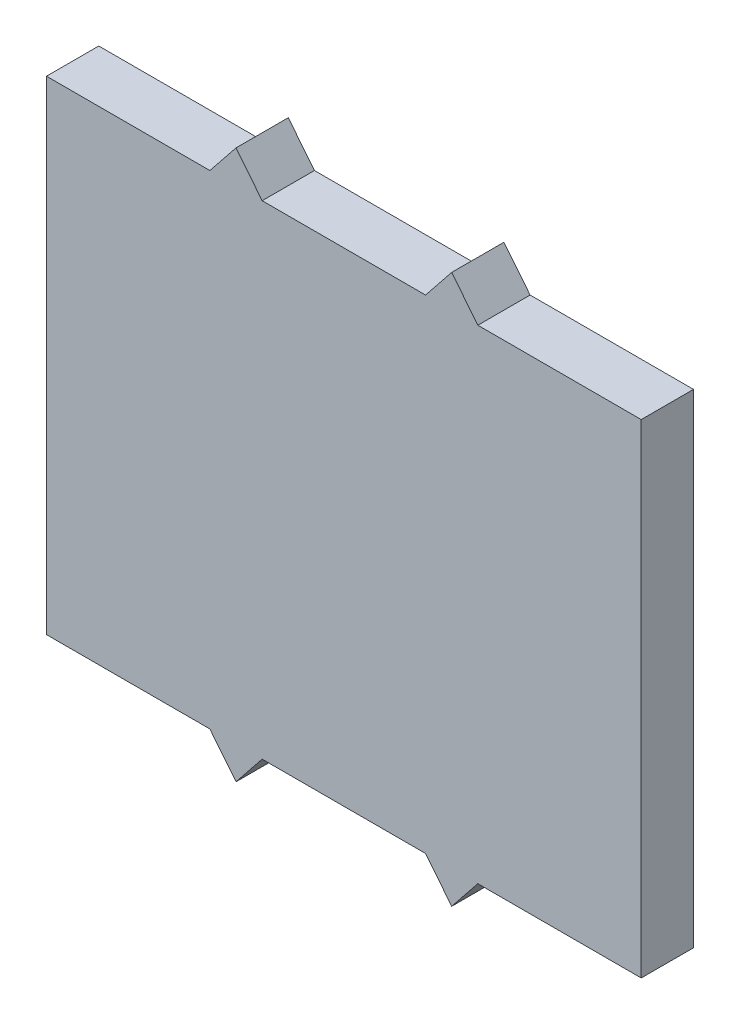
ISO-10303-21;
HEADER;
FILE_DESCRIPTION(('STEP AP214'),'2;1');
FILE_NAME('part.step','',(''),(''),'','','');
FILE_SCHEMA(('AUTOMOTIVE_DESIGN { 1 0 10303 214 1 1 1 1 }'));
ENDSEC;
DATA;
#1=APPLICATION_CONTEXT('core data for automotive mechanical design processes');
#2=APPLICATION_PROTOCOL_DEFINITION('international standard','automotive_design',2000,#1);
#3=PRODUCT_CONTEXT('',#1,'mechanical');
#4=PRODUCT('Part','Part','',(#3));
#5=PRODUCT_RELATED_PRODUCT_CATEGORY('part','',(#4));
#6=PRODUCT_DEFINITION_FORMATION('','',#4);
#7=PRODUCT_DEFINITION_CONTEXT('part definition',#1,'design');
#8=PRODUCT_DEFINITION('design','',#6,#7);
#9=PRODUCT_DEFINITION_SHAPE('','',#8);
#10=(LENGTH_UNIT() NAMED_UNIT(*) SI_UNIT(.MILLI.,.METRE.));
#11=(NAMED_UNIT(*) PLANE_ANGLE_UNIT() SI_UNIT($,.RADIAN.));
#12=(NAMED_UNIT(*) SI_UNIT($,.STERADIAN.) SOLID_ANGLE_UNIT());
#13=UNCERTAINTY_MEASURE_WITH_UNIT(LENGTH_MEASURE(1.E-05),#10,'distance_accuracy_value','');
#14=(GEOMETRIC_REPRESENTATION_CONTEXT(3) GLOBAL_UNCERTAINTY_ASSIGNED_CONTEXT((#13)) GLOBAL_UNIT_ASSIGNED_CONTEXT((#10,
#11,#12)) REPRESENTATION_CONTEXT('',''));
#15=CARTESIAN_POINT('',(0.,0.,0.));
#16=DIRECTION('',(0.,0.,1.));
#17=DIRECTION('',(1.,0.,0.));
#18=AXIS2_PLACEMENT_3D('',#15,#16,#17);
#19=CARTESIAN_POINT('',(0.,0.,4.));
#20=DIRECTION('',(0.,1.,0.));
#21=DIRECTION('',(0.,0.,1.));
#22=AXIS2_PLACEMENT_3D('',#19,#20,#21);
#23=PLANE('',#22);
#24=DIRECTION('',(1.,0.,0.));
#25=VECTOR('',#24,1.);
#26=CARTESIAN_POINT('',(0.,0.,0.));
#27=LINE('',#26,#25);
#28=CARTESIAN_POINT('',(0.,0.,0.));
#29=VERTEX_POINT('',#28);
#30=CARTESIAN_POINT('',(12.5,0.,0.));
#31=VERTEX_POINT('',#30);
#32=EDGE_CURVE('E254',#29,#31,#27,.T.);
#33=ORIENTED_EDGE('',*,*,#32,.T.);
#34=DIRECTION('',(0.,0.,-1.));
#35=VECTOR('',#34,1.);
#36=CARTESIAN_POINT('',(12.5,0.,4.));
#37=LINE('',#36,#35);
#38=CARTESIAN_POINT('',(12.5,0.,4.));
#39=VERTEX_POINT('',#38);
#40=EDGE_CURVE('E11',#39,#31,#37,.T.);
#41=ORIENTED_EDGE('',*,*,#40,.F.);
#42=DIRECTION('',(1.,0.,0.));
#43=VECTOR('',#42,1.);
#44=CARTESIAN_POINT('',(0.,0.,4.));
#45=LINE('',#44,#43);
#46=CARTESIAN_POINT('',(0.,0.,4.));
#47=VERTEX_POINT('',#46);
#48=EDGE_CURVE('E200',#47,#39,#45,.T.);
#49=ORIENTED_EDGE('',*,*,#48,.F.);
#50=DIRECTION('',(0.,0.,-1.));
#51=VECTOR('',#50,1.);
#52=CARTESIAN_POINT('',(0.,0.,4.));
#53=LINE('',#52,#51);
#54=EDGE_CURVE('E56',#47,#29,#53,.T.);
#55=ORIENTED_EDGE('',*,*,#54,.T.);
#56=EDGE_LOOP('',(#33,#41,#49,#55));
#57=FACE_BOUND('',#56,.T.);
#58=ADVANCED_FACE('F39',(#57),#23,.F.);
#59=CARTESIAN_POINT('',(7.6219512195122,6.09756097560976,4.));
#60=DIRECTION('',(0.78086880944303,0.624695047554424,0.));
#61=DIRECTION('',(-0.624695047554424,0.78086880944303,0.));
#62=AXIS2_PLACEMENT_3D('',#59,#60,#61);
#63=PLANE('',#62);
#64=DIRECTION('',(0.624695047554424,-0.78086880944303,0.));
#65=VECTOR('',#64,1.);
#66=CARTESIAN_POINT('',(7.6219512195122,6.09756097560976,0.));
#67=LINE('',#66,#65);
#68=CARTESIAN_POINT('',(14.5,-2.5,0.));
#69=VERTEX_POINT('',#68);
#70=EDGE_CURVE('E251',#31,#69,#67,.T.);
#71=ORIENTED_EDGE('',*,*,#70,.T.);
#72=DIRECTION('',(0.,0.,-1.));
#73=VECTOR('',#72,1.);
#74=CARTESIAN_POINT('',(14.5,-2.5,4.));
#75=LINE('',#74,#73);
#76=CARTESIAN_POINT('',(14.5,-2.5,4.));
#77=VERTEX_POINT('',#76);
#78=EDGE_CURVE('E48',#77,#69,#75,.T.);
#79=ORIENTED_EDGE('',*,*,#78,.F.);
#80=DIRECTION('',(0.624695047554424,-0.78086880944303,0.));
#81=VECTOR('',#80,1.);
#82=CARTESIAN_POINT('',(7.6219512195122,6.09756097560976,4.));
#83=LINE('',#82,#81);
#84=EDGE_CURVE('E118',#39,#77,#83,.T.);
#85=ORIENTED_EDGE('',*,*,#84,.F.);
#86=ORIENTED_EDGE('',*,*,#40,.T.);
#87=EDGE_LOOP('',(#71,#79,#85,#86));
#88=FACE_BOUND('',#87,.T.);
#89=ADVANCED_FACE('F41',(#88),#63,.F.);
#90=CARTESIAN_POINT('',(10.0609756097561,-8.04878048780488,4.));
#91=DIRECTION('',(-0.780868809443031,0.624695047554424,0.));
#92=DIRECTION('',(-0.624695047554424,-0.780868809443031,0.));
#93=AXIS2_PLACEMENT_3D('',#90,#91,#92);
#94=PLANE('',#93);
#95=DIRECTION('',(0.624695047554424,0.780868809443031,0.));
#96=VECTOR('',#95,1.);
#97=CARTESIAN_POINT('',(10.0609756097561,-8.04878048780488,0.));
#98=LINE('',#97,#96);
#99=CARTESIAN_POINT('',(16.5,0.,0.));
#100=VERTEX_POINT('',#99);
#101=EDGE_CURVE('E248',#69,#100,#98,.T.);
#102=ORIENTED_EDGE('',*,*,#101,.T.);
#103=DIRECTION('',(0.,0.,-1.));
#104=VECTOR('',#103,1.);
#105=CARTESIAN_POINT('',(16.5,0.,4.));
#106=LINE('',#105,#104);
#107=CARTESIAN_POINT('',(16.5,0.,4.));
#108=VERTEX_POINT('',#107);
#109=EDGE_CURVE('E230',#108,#100,#106,.T.);
#110=ORIENTED_EDGE('',*,*,#109,.F.);
#111=DIRECTION('',(0.624695047554424,0.780868809443031,0.));
#112=VECTOR('',#111,1.);
#113=CARTESIAN_POINT('',(10.0609756097561,-8.04878048780488,4.));
#114=LINE('',#113,#112);
#115=EDGE_CURVE('E207',#77,#108,#114,.T.);
#116=ORIENTED_EDGE('',*,*,#115,.F.);
#117=ORIENTED_EDGE('',*,*,#78,.T.);
#118=EDGE_LOOP('',(#102,#110,#116,#117));
#119=FACE_BOUND('',#118,.T.);
#120=ADVANCED_FACE('F247',(#119),#94,.F.);
#121=CARTESIAN_POINT('',(29.,0.,0.));
#122=VERTEX_POINT('',#121);
#123=EDGE_CURVE('E226',#100,#122,#27,.T.);
#124=ORIENTED_EDGE('',*,*,#123,.T.);
#125=DIRECTION('',(0.,0.,-1.));
#126=VECTOR('',#125,1.);
#127=CARTESIAN_POINT('',(29.,0.,4.));
#128=LINE('',#127,#126);
#129=CARTESIAN_POINT('',(29.,0.,4.));
#130=VERTEX_POINT('',#129);
#131=EDGE_CURVE('E223',#130,#122,#128,.T.);
#132=ORIENTED_EDGE('',*,*,#131,.F.);
#133=EDGE_CURVE('E199',#108,#130,#45,.T.);
#134=ORIENTED_EDGE('',*,*,#133,.F.);
#135=ORIENTED_EDGE('',*,*,#109,.T.);
#136=EDGE_LOOP('',(#124,#132,#134,#135));
#137=FACE_BOUND('',#136,.T.);
#138=ADVANCED_FACE('F224',(#137),#23,.F.);
#139=CARTESIAN_POINT('',(17.6829268292683,14.1463414634146,4.));
#140=DIRECTION('',(-0.78086880944303,-0.624695047554424,0.));
#141=DIRECTION('',(0.624695047554424,-0.78086880944303,0.));
#142=AXIS2_PLACEMENT_3D('',#139,#140,#141);
#143=PLANE('',#142);
#144=DIRECTION('',(-0.624695047554424,0.78086880944303,0.));
#145=VECTOR('',#144,1.);
#146=CARTESIAN_POINT('',(17.6829268292683,14.1463414634146,0.));
#147=LINE('',#146,#145);
#148=CARTESIAN_POINT('',(31.,-2.5,0.));
#149=VERTEX_POINT('',#148);
#150=EDGE_CURVE('E234',#149,#122,#147,.T.);
#151=ORIENTED_EDGE('',*,*,#150,.F.);
#152=DIRECTION('',(0.,0.,-1.));
#153=VECTOR('',#152,1.);
#154=CARTESIAN_POINT('',(31.,-2.5,4.));
#155=LINE('',#154,#153);
#156=CARTESIAN_POINT('',(31.,-2.5,4.));
#157=VERTEX_POINT('',#156);
#158=EDGE_CURVE('E231',#157,#149,#155,.T.);
#159=ORIENTED_EDGE('',*,*,#158,.F.);
#160=DIRECTION('',(-0.624695047554424,0.78086880944303,0.));
#161=VECTOR('',#160,1.);
#162=CARTESIAN_POINT('',(17.6829268292683,14.1463414634146,4.));
#163=LINE('',#162,#161);
#164=EDGE_CURVE('E204',#157,#130,#163,.T.);
#165=ORIENTED_EDGE('',*,*,#164,.T.);
#166=ORIENTED_EDGE('',*,*,#131,.T.);
#167=EDGE_LOOP('',(#151,#159,#165,#166));
#168=FACE_BOUND('',#167,.T.);
#169=ADVANCED_FACE('F233',(#168),#143,.T.);
#170=CARTESIAN_POINT('',(20.1219512195122,-16.0975609756098,4.));
#171=DIRECTION('',(0.78086880944303,-0.624695047554424,0.));
#172=DIRECTION('',(0.624695047554424,0.78086880944303,0.));
#173=AXIS2_PLACEMENT_3D('',#170,#171,#172);
#174=PLANE('',#173);
#175=DIRECTION('',(-0.624695047554424,-0.78086880944303,0.));
#176=VECTOR('',#175,1.);
#177=CARTESIAN_POINT('',(20.1219512195122,-16.0975609756098,0.));
#178=LINE('',#177,#176);
#179=CARTESIAN_POINT('',(33.,0.,0.));
#180=VERTEX_POINT('',#179);
#181=EDGE_CURVE('E259',#180,#149,#178,.T.);
#182=ORIENTED_EDGE('',*,*,#181,.F.);
#183=DIRECTION('',(0.,0.,-1.));
#184=VECTOR('',#183,1.);
#185=CARTESIAN_POINT('',(33.,0.,4.));
#186=LINE('',#185,#184);
#187=CARTESIAN_POINT('',(33.,0.,4.));
#188=VERTEX_POINT('',#187);
#189=EDGE_CURVE('E238',#188,#180,#186,.T.);
#190=ORIENTED_EDGE('',*,*,#189,.F.);
#191=DIRECTION('',(-0.624695047554424,-0.78086880944303,0.));
#192=VECTOR('',#191,1.);
#193=CARTESIAN_POINT('',(20.1219512195122,-16.0975609756098,4.));
#194=LINE('',#193,#192);
#195=EDGE_CURVE('E197',#188,#157,#194,.T.);
#196=ORIENTED_EDGE('',*,*,#195,.T.);
#197=ORIENTED_EDGE('',*,*,#158,.T.);
#198=EDGE_LOOP('',(#182,#190,#196,#197));
#199=FACE_BOUND('',#198,.T.);
#200=ADVANCED_FACE('F320',(#199),#174,.T.);
#201=CARTESIAN_POINT('',(45.5,0.,0.));
#202=VERTEX_POINT('',#201);
#203=EDGE_CURVE('E255',#180,#202,#27,.T.);
#204=ORIENTED_EDGE('',*,*,#203,.T.);
#205=DIRECTION('',(0.,0.,-1.));
#206=VECTOR('',#205,1.);
#207=CARTESIAN_POINT('',(45.5,0.,4.));
#208=LINE('',#207,#206);
#209=CARTESIAN_POINT('',(45.5,0.,4.));
#210=VERTEX_POINT('',#209);
#211=EDGE_CURVE('E240',#210,#202,#208,.T.);
#212=ORIENTED_EDGE('',*,*,#211,.F.);
#213=EDGE_CURVE('E194',#188,#210,#45,.T.);
#214=ORIENTED_EDGE('',*,*,#213,.F.);
#215=ORIENTED_EDGE('',*,*,#189,.T.);
#216=EDGE_LOOP('',(#204,#212,#214,#215));
#217=FACE_BOUND('',#216,.T.);
#218=ADVANCED_FACE('F319',(#217),#23,.F.);
#219=CARTESIAN_POINT('',(45.5,0.,4.));
#220=DIRECTION('',(-1.,0.,0.));
#221=DIRECTION('',(0.,0.,1.));
#222=AXIS2_PLACEMENT_3D('',#219,#220,#221);
#223=PLANE('',#222);
#224=DIRECTION('',(0.,1.,0.));
#225=VECTOR('',#224,1.);
#226=CARTESIAN_POINT('',(45.5,0.,0.));
#227=LINE('',#226,#225);
#228=CARTESIAN_POINT('',(45.5,37.,0.));
#229=VERTEX_POINT('',#228);
#230=EDGE_CURVE('E261',#202,#229,#227,.T.);
#231=ORIENTED_EDGE('',*,*,#230,.T.);
#232=DIRECTION('',(0.,0.,-1.));
#233=VECTOR('',#232,1.);
#234=CARTESIAN_POINT('',(45.5,37.,4.));
#235=LINE('',#234,#233);
#236=CARTESIAN_POINT('',(45.5,37.,4.));
#237=VERTEX_POINT('',#236);
#238=EDGE_CURVE('E289',#237,#229,#235,.T.);
#239=ORIENTED_EDGE('',*,*,#238,.F.);
#240=DIRECTION('',(0.,1.,0.));
#241=VECTOR('',#240,1.);
#242=CARTESIAN_POINT('',(45.5,0.,4.));
#243=LINE('',#242,#241);
#244=EDGE_CURVE('E191',#210,#237,#243,.T.);
#245=ORIENTED_EDGE('',*,*,#244,.F.);
#246=ORIENTED_EDGE('',*,*,#211,.T.);
#247=EDGE_LOOP('',(#231,#239,#245,#246));
#248=FACE_BOUND('',#247,.T.);
#249=ADVANCED_FACE('F294',(#248),#223,.F.);
#250=CARTESIAN_POINT('',(0.,37.,4.));
#251=DIRECTION('',(0.,1.,0.));
#252=DIRECTION('',(-1.,0.,0.));
#253=AXIS2_PLACEMENT_3D('',#250,#251,#252);
#254=PLANE('',#253);
#255=DIRECTION('',(1.,0.,0.));
#256=VECTOR('',#255,1.);
#257=CARTESIAN_POINT('',(0.,37.,0.));
#258=LINE('',#257,#256);
#259=CARTESIAN_POINT('',(33.,37.,0.));
#260=VERTEX_POINT('',#259);
#261=EDGE_CURVE('E264',#260,#229,#258,.T.);
#262=ORIENTED_EDGE('',*,*,#261,.F.);
#263=DIRECTION('',(0.,0.,-1.));
#264=VECTOR('',#263,1.);
#265=CARTESIAN_POINT('',(33.,37.,4.));
#266=LINE('',#265,#264);
#267=CARTESIAN_POINT('',(33.,37.,4.));
#268=VERTEX_POINT('',#267);
#269=EDGE_CURVE('E287',#268,#260,#266,.T.);
#270=ORIENTED_EDGE('',*,*,#269,.F.);
#271=DIRECTION('',(1.,0.,0.));
#272=VECTOR('',#271,1.);
#273=CARTESIAN_POINT('',(0.,37.,4.));
#274=LINE('',#273,#272);
#275=EDGE_CURVE('E183',#268,#237,#274,.T.);
#276=ORIENTED_EDGE('',*,*,#275,.T.);
#277=ORIENTED_EDGE('',*,*,#238,.T.);
#278=EDGE_LOOP('',(#262,#270,#276,#277));
#279=FACE_BOUND('',#278,.T.);
#280=ADVANCED_FACE('F301',(#279),#254,.T.);
#281=CARTESIAN_POINT('',(38.1707317073171,30.5365853658537,4.));
#282=DIRECTION('',(-0.78086880944303,-0.624695047554424,0.));
#283=DIRECTION('',(0.624695047554424,-0.78086880944303,0.));
#284=AXIS2_PLACEMENT_3D('',#281,#282,#283);
#285=PLANE('',#284);
#286=DIRECTION('',(-0.624695047554424,0.78086880944303,0.));
#287=VECTOR('',#286,1.);
#288=CARTESIAN_POINT('',(38.1707317073171,30.5365853658537,0.));
#289=LINE('',#288,#287);
#290=CARTESIAN_POINT('',(31.,39.5,0.));
#291=VERTEX_POINT('',#290);
#292=EDGE_CURVE('E267',#260,#291,#289,.T.);
#293=ORIENTED_EDGE('',*,*,#292,.T.);
#294=DIRECTION('',(0.,0.,-1.));
#295=VECTOR('',#294,1.);
#296=CARTESIAN_POINT('',(31.,39.5,4.));
#297=LINE('',#296,#295);
#298=CARTESIAN_POINT('',(31.,39.5,4.));
#299=VERTEX_POINT('',#298);
#300=EDGE_CURVE('E284',#299,#291,#297,.T.);
#301=ORIENTED_EDGE('',*,*,#300,.F.);
#302=DIRECTION('',(-0.624695047554424,0.78086880944303,0.));
#303=VECTOR('',#302,1.);
#304=CARTESIAN_POINT('',(38.1707317073171,30.5365853658537,4.));
#305=LINE('',#304,#303);
#306=EDGE_CURVE('E190',#268,#299,#305,.T.);
#307=ORIENTED_EDGE('',*,*,#306,.F.);
#308=ORIENTED_EDGE('',*,*,#269,.T.);
#309=EDGE_LOOP('',(#293,#301,#307,#308));
#310=FACE_BOUND('',#309,.T.);
#311=ADVANCED_FACE('F305',(#310),#285,.F.);
#312=CARTESIAN_POINT('',(-0.365853658536584,0.292682926829267,4.));
#313=DIRECTION('',(0.78086880944303,-0.624695047554424,0.));
#314=DIRECTION('',(0.624695047554424,0.78086880944303,0.));
#315=AXIS2_PLACEMENT_3D('',#312,#313,#314);
#316=PLANE('',#315);
#317=DIRECTION('',(-0.624695047554424,-0.78086880944303,0.));
#318=VECTOR('',#317,1.);
#319=CARTESIAN_POINT('',(-0.365853658536584,0.292682926829267,0.));
#320=LINE('',#319,#318);
#321=CARTESIAN_POINT('',(29.,37.,0.));
#322=VERTEX_POINT('',#321);
#323=EDGE_CURVE('E270',#291,#322,#320,.T.);
#324=ORIENTED_EDGE('',*,*,#323,.T.);
#325=DIRECTION('',(0.,0.,-1.));
#326=VECTOR('',#325,1.);
#327=CARTESIAN_POINT('',(29.,37.,4.));
#328=LINE('',#327,#326);
#329=CARTESIAN_POINT('',(29.,37.,4.));
#330=VERTEX_POINT('',#329);
#331=EDGE_CURVE('E282',#330,#322,#328,.T.);
#332=ORIENTED_EDGE('',*,*,#331,.F.);
#333=DIRECTION('',(-0.624695047554424,-0.78086880944303,0.));
#334=VECTOR('',#333,1.);
#335=CARTESIAN_POINT('',(-0.365853658536584,0.292682926829267,4.));
#336=LINE('',#335,#334);
#337=EDGE_CURVE('E188',#299,#330,#336,.T.);
#338=ORIENTED_EDGE('',*,*,#337,.F.);
#339=ORIENTED_EDGE('',*,*,#300,.T.);
#340=EDGE_LOOP('',(#324,#332,#338,#339));
#341=FACE_BOUND('',#340,.T.);
#342=ADVANCED_FACE('F310',(#341),#316,.F.);
#343=CARTESIAN_POINT('',(16.5,37.,0.));
#344=VERTEX_POINT('',#343);
#345=EDGE_CURVE('E268',#344,#322,#258,.T.);
#346=ORIENTED_EDGE('',*,*,#345,.F.);
#347=DIRECTION('',(0.,0.,-1.));
#348=VECTOR('',#347,1.);
#349=CARTESIAN_POINT('',(16.5,37.,4.));
#350=LINE('',#349,#348);
#351=CARTESIAN_POINT('',(16.5,37.,4.));
#352=VERTEX_POINT('',#351);
#353=EDGE_CURVE('E280',#352,#344,#350,.T.);
#354=ORIENTED_EDGE('',*,*,#353,.F.);
#355=EDGE_CURVE('E182',#352,#330,#274,.T.);
#356=ORIENTED_EDGE('',*,*,#355,.T.);
#357=ORIENTED_EDGE('',*,*,#331,.T.);
#358=EDGE_LOOP('',(#346,#354,#356,#357));
#359=FACE_BOUND('',#358,.T.);
#360=ADVANCED_FACE('F314',(#359),#254,.T.);
#361=CARTESIAN_POINT('',(28.109756097561,22.4878048780488,4.));
#362=DIRECTION('',(0.78086880944303,0.624695047554424,0.));
#363=DIRECTION('',(-0.624695047554424,0.78086880944303,0.));
#364=AXIS2_PLACEMENT_3D('',#361,#362,#363);
#365=PLANE('',#364);
#366=DIRECTION('',(0.624695047554424,-0.78086880944303,0.));
#367=VECTOR('',#366,1.);
#368=CARTESIAN_POINT('',(28.109756097561,22.4878048780488,0.));
#369=LINE('',#368,#367);
#370=CARTESIAN_POINT('',(14.5,39.5,0.));
#371=VERTEX_POINT('',#370);
#372=EDGE_CURVE('E273',#371,#344,#369,.T.);
#373=ORIENTED_EDGE('',*,*,#372,.F.);
#374=DIRECTION('',(0.,0.,-1.));
#375=VECTOR('',#374,1.);
#376=CARTESIAN_POINT('',(14.5,39.5,4.));
#377=LINE('',#376,#375);
#378=CARTESIAN_POINT('',(14.5,39.5,4.));
#379=VERTEX_POINT('',#378);
#380=EDGE_CURVE('E167',#379,#371,#377,.T.);
#381=ORIENTED_EDGE('',*,*,#380,.F.);
#382=DIRECTION('',(0.624695047554424,-0.78086880944303,0.));
#383=VECTOR('',#382,1.);
#384=CARTESIAN_POINT('',(28.109756097561,22.4878048780488,4.));
#385=LINE('',#384,#383);
#386=EDGE_CURVE('E177',#379,#352,#385,.T.);
#387=ORIENTED_EDGE('',*,*,#386,.T.);
#388=ORIENTED_EDGE('',*,*,#353,.T.);
#389=EDGE_LOOP('',(#373,#381,#387,#388));
#390=FACE_BOUND('',#389,.T.);
#391=ADVANCED_FACE('F317',(#390),#365,.T.);
#392=CARTESIAN_POINT('',(-10.4268292682927,8.34146341463413,4.));
#393=DIRECTION('',(-0.780868809443031,0.624695047554424,0.));
#394=DIRECTION('',(-0.624695047554424,-0.780868809443031,0.));
#395=AXIS2_PLACEMENT_3D('',#392,#393,#394);
#396=PLANE('',#395);
#397=DIRECTION('',(0.624695047554424,0.780868809443031,0.));
#398=VECTOR('',#397,1.);
#399=CARTESIAN_POINT('',(-10.4268292682927,8.34146341463413,0.));
#400=LINE('',#399,#398);
#401=CARTESIAN_POINT('',(12.5,37.,0.));
#402=VERTEX_POINT('',#401);
#403=EDGE_CURVE('E163',#402,#371,#400,.T.);
#404=ORIENTED_EDGE('',*,*,#403,.F.);
#405=DIRECTION('',(0.,0.,-1.));
#406=VECTOR('',#405,1.);
#407=CARTESIAN_POINT('',(12.5,37.,4.));
#408=LINE('',#407,#406);
#409=CARTESIAN_POINT('',(12.5,37.,4.));
#410=VERTEX_POINT('',#409);
#411=EDGE_CURVE('E158',#410,#402,#408,.T.);
#412=ORIENTED_EDGE('',*,*,#411,.F.);
#413=DIRECTION('',(0.624695047554424,0.780868809443031,0.));
#414=VECTOR('',#413,1.);
#415=CARTESIAN_POINT('',(-10.4268292682927,8.34146341463413,4.));
#416=LINE('',#415,#414);
#417=EDGE_CURVE('E161',#410,#379,#416,.T.);
#418=ORIENTED_EDGE('',*,*,#417,.T.);
#419=ORIENTED_EDGE('',*,*,#380,.T.);
#420=EDGE_LOOP('',(#404,#412,#418,#419));
#421=FACE_BOUND('',#420,.T.);
#422=ADVANCED_FACE('F160',(#421),#396,.T.);
#423=CARTESIAN_POINT('',(0.,37.,0.));
#424=VERTEX_POINT('',#423);
#425=EDGE_CURVE('E212',#424,#402,#258,.T.);
#426=ORIENTED_EDGE('',*,*,#425,.F.);
#427=DIRECTION('',(0.,0.,-1.));
#428=VECTOR('',#427,1.);
#429=CARTESIAN_POINT('',(0.,37.,4.));
#430=LINE('',#429,#428);
#431=CARTESIAN_POINT('',(0.,37.,4.));
#432=VERTEX_POINT('',#431);
#433=EDGE_CURVE('E106',#432,#424,#430,.T.);
#434=ORIENTED_EDGE('',*,*,#433,.F.);
#435=EDGE_CURVE('E174',#432,#410,#274,.T.);
#436=ORIENTED_EDGE('',*,*,#435,.T.);
#437=ORIENTED_EDGE('',*,*,#411,.T.);
#438=EDGE_LOOP('',(#426,#434,#436,#437));
#439=FACE_BOUND('',#438,.T.);
#440=ADVANCED_FACE('F179',(#439),#254,.T.);
#441=CARTESIAN_POINT('',(0.,0.,4.));
#442=DIRECTION('',(-1.,0.,0.));
#443=DIRECTION('',(0.,0.,1.));
#444=AXIS2_PLACEMENT_3D('',#441,#442,#443);
#445=PLANE('',#444);
#446=DIRECTION('',(0.,1.,0.));
#447=VECTOR('',#446,1.);
#448=CARTESIAN_POINT('',(0.,0.,0.));
#449=LINE('',#448,#447);
#450=EDGE_CURVE('E209',#29,#424,#449,.T.);
#451=ORIENTED_EDGE('',*,*,#450,.F.);
#452=ORIENTED_EDGE('',*,*,#54,.F.);
#453=DIRECTION('',(0.,1.,0.));
#454=VECTOR('',#453,1.);
#455=CARTESIAN_POINT('',(0.,0.,4.));
#456=LINE('',#455,#454);
#457=EDGE_CURVE('E180',#47,#432,#456,.T.);
#458=ORIENTED_EDGE('',*,*,#457,.T.);
#459=ORIENTED_EDGE('',*,*,#433,.T.);
#460=EDGE_LOOP('',(#451,#452,#458,#459));
#461=FACE_BOUND('',#460,.T.);
#462=ADVANCED_FACE('F425',(#461),#445,.T.);
#463=CARTESIAN_POINT('',(0.,0.,4.));
#464=DIRECTION('',(0.,0.,1.));
#465=DIRECTION('',(1.,0.,0.));
#466=AXIS2_PLACEMENT_3D('',#463,#464,#465);
#467=PLANE('',#466);
#468=ORIENTED_EDGE('',*,*,#48,.T.);
#469=ORIENTED_EDGE('',*,*,#84,.T.);
#470=ORIENTED_EDGE('',*,*,#115,.T.);
#471=ORIENTED_EDGE('',*,*,#133,.T.);
#472=ORIENTED_EDGE('',*,*,#164,.F.);
#473=ORIENTED_EDGE('',*,*,#195,.F.);
#474=ORIENTED_EDGE('',*,*,#213,.T.);
#475=ORIENTED_EDGE('',*,*,#244,.T.);
#476=ORIENTED_EDGE('',*,*,#275,.F.);
#477=ORIENTED_EDGE('',*,*,#306,.T.);
#478=ORIENTED_EDGE('',*,*,#337,.T.);
#479=ORIENTED_EDGE('',*,*,#355,.F.);
#480=ORIENTED_EDGE('',*,*,#386,.F.);
#481=ORIENTED_EDGE('',*,*,#417,.F.);
#482=ORIENTED_EDGE('',*,*,#435,.F.);
#483=ORIENTED_EDGE('',*,*,#457,.F.);
#484=EDGE_LOOP('',(#468,#469,#470,#471,#472,#473,#474,#475,#476,#477,#478,#479,#480,#481,#482,#483));
#485=FACE_BOUND('',#484,.T.);
#486=ADVANCED_FACE('F172',(#485),#467,.T.);
#487=CARTESIAN_POINT('',(0.,0.,0.));
#488=DIRECTION('',(0.,0.,1.));
#489=DIRECTION('',(1.,0.,0.));
#490=AXIS2_PLACEMENT_3D('',#487,#488,#489);
#491=PLANE('',#490);
#492=ORIENTED_EDGE('',*,*,#32,.F.);
#493=ORIENTED_EDGE('',*,*,#450,.T.);
#494=ORIENTED_EDGE('',*,*,#425,.T.);
#495=ORIENTED_EDGE('',*,*,#403,.T.);
#496=ORIENTED_EDGE('',*,*,#372,.T.);
#497=ORIENTED_EDGE('',*,*,#345,.T.);
#498=ORIENTED_EDGE('',*,*,#323,.F.);
#499=ORIENTED_EDGE('',*,*,#292,.F.);
#500=ORIENTED_EDGE('',*,*,#261,.T.);
#501=ORIENTED_EDGE('',*,*,#230,.F.);
#502=ORIENTED_EDGE('',*,*,#203,.F.);
#503=ORIENTED_EDGE('',*,*,#181,.T.);
#504=ORIENTED_EDGE('',*,*,#150,.T.);
#505=ORIENTED_EDGE('',*,*,#123,.F.);
#506=ORIENTED_EDGE('',*,*,#101,.F.);
#507=ORIENTED_EDGE('',*,*,#70,.F.);
#508=EDGE_LOOP('',(#492,#493,#494,#495,#496,#497,#498,#499,#500,#501,#502,#503,#504,#505,#506,#507));
#509=FACE_BOUND('',#508,.T.);
#510=ADVANCED_FACE('F250',(#509),#491,.F.);
#511=CLOSED_SHELL('',(#58,#89,#120,#138,#169,#200,#218,#249,#280,#311,#342,#360,#391,#422,#440,
#462,#486,#510));
#512=MANIFOLD_SOLID_BREP('B2',#511);
#513=ADVANCED_BREP_SHAPE_REPRESENTATION('',(#18,#512),#14);
#514=SHAPE_DEFINITION_REPRESENTATION(#9,#513);
ENDSEC;
END-ISO-10303-21;
